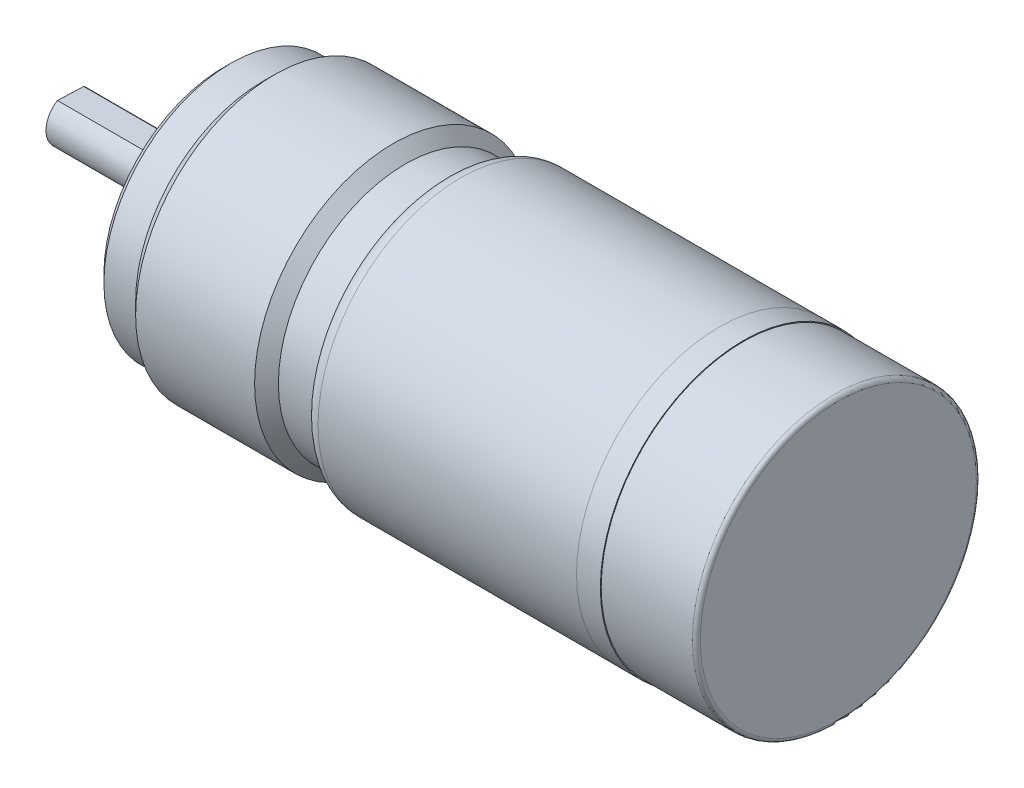
ISO-10303-21;
HEADER;
FILE_DESCRIPTION(('STEP AP214'),'2;1');
FILE_NAME('part.step','',(''),(''),'','','');
FILE_SCHEMA(('AUTOMOTIVE_DESIGN { 1 0 10303 214 1 1 1 1 }'));
ENDSEC;
DATA;
#1=APPLICATION_CONTEXT('core data for automotive mechanical design processes');
#2=APPLICATION_PROTOCOL_DEFINITION('international standard','automotive_design',2000,#1);
#3=PRODUCT_CONTEXT('',#1,'mechanical');
#4=PRODUCT('Part','Part','',(#3));
#5=PRODUCT_RELATED_PRODUCT_CATEGORY('part','',(#4));
#6=PRODUCT_DEFINITION_FORMATION('','',#4);
#7=PRODUCT_DEFINITION_CONTEXT('part definition',#1,'design');
#8=PRODUCT_DEFINITION('design','',#6,#7);
#9=PRODUCT_DEFINITION_SHAPE('','',#8);
#10=(LENGTH_UNIT() NAMED_UNIT(*) SI_UNIT(.MILLI.,.METRE.));
#11=(NAMED_UNIT(*) PLANE_ANGLE_UNIT() SI_UNIT($,.RADIAN.));
#12=(NAMED_UNIT(*) SI_UNIT($,.STERADIAN.) SOLID_ANGLE_UNIT());
#13=UNCERTAINTY_MEASURE_WITH_UNIT(LENGTH_MEASURE(1.E-05),#10,'distance_accuracy_value','');
#14=(GEOMETRIC_REPRESENTATION_CONTEXT(3) GLOBAL_UNCERTAINTY_ASSIGNED_CONTEXT((#13)) GLOBAL_UNIT_ASSIGNED_CONTEXT((#10,
#11,#12)) REPRESENTATION_CONTEXT('',''));
#15=CARTESIAN_POINT('',(0.,0.,0.));
#16=DIRECTION('',(0.,0.,1.));
#17=DIRECTION('',(1.,0.,0.));
#18=AXIS2_PLACEMENT_3D('',#15,#16,#17);
#19=CARTESIAN_POINT('',(26.3,0.,0.));
#20=DIRECTION('',(-1.,0.,0.));
#21=DIRECTION('',(0.,-1.,0.));
#22=AXIS2_PLACEMENT_3D('',#19,#20,#21);
#23=PLANE('',#22);
#24=CARTESIAN_POINT('',(26.3,9.19238815542526,9.19238815542498));
#25=DIRECTION('',(-1.,0.,0.));
#26=DIRECTION('',(0.,-1.,0.));
#27=AXIS2_PLACEMENT_3D('',#24,#25,#26);
#28=CIRCLE('',#27,1.5);
#29=CARTESIAN_POINT('',(26.3,7.69238815542527,9.19238815542499));
#30=VERTEX_POINT('',#29);
#31=EDGE_CURVE('E43',#30,#30,#28,.T.);
#32=ORIENTED_EDGE('',*,*,#31,.T.);
#33=EDGE_LOOP('',(#32));
#34=FACE_BOUND('',#33,.T.);
#35=ADVANCED_FACE('F36',(#34),#23,.T.);
#36=CARTESIAN_POINT('',(26.3,9.19238815542526,9.19238815542498));
#37=DIRECTION('',(-1.,0.,0.));
#38=DIRECTION('',(0.,-1.,0.));
#39=AXIS2_PLACEMENT_3D('',#36,#37,#38);
#40=CYLINDRICAL_SURFACE('',#39,1.5);
#41=ORIENTED_EDGE('',*,*,#31,.F.);
#42=EDGE_LOOP('',(#41));
#43=FACE_BOUND('',#42,.T.);
#44=CARTESIAN_POINT('',(19.3,9.19238815542526,9.19238815542498));
#45=DIRECTION('',(-1.,0.,0.));
#46=DIRECTION('',(0.,-1.,0.));
#47=AXIS2_PLACEMENT_3D('',#44,#45,#46);
#48=CIRCLE('',#47,1.5);
#49=CARTESIAN_POINT('',(19.3,7.69238815542527,9.19238815542499));
#50=VERTEX_POINT('',#49);
#51=EDGE_CURVE('E11',#50,#50,#48,.T.);
#52=ORIENTED_EDGE('',*,*,#51,.T.);
#53=EDGE_LOOP('',(#52));
#54=FACE_BOUND('',#53,.T.);
#55=ADVANCED_FACE('F160',(#43,#54),#40,.F.);
#56=CARTESIAN_POINT('',(26.3,0.,0.));
#57=DIRECTION('',(-1.,0.,0.));
#58=DIRECTION('',(0.,0.,-1.));
#59=AXIS2_PLACEMENT_3D('',#56,#57,#58);
#60=PLANE('',#59);
#61=CARTESIAN_POINT('',(26.3,-9.19238815542507,9.19238815542517));
#62=DIRECTION('',(-1.,0.,0.));
#63=DIRECTION('',(0.,0.,-1.));
#64=AXIS2_PLACEMENT_3D('',#61,#62,#63);
#65=CIRCLE('',#64,1.5);
#66=CARTESIAN_POINT('',(26.3,-9.19238815542507,7.69238815542517));
#67=VERTEX_POINT('',#66);
#68=EDGE_CURVE('E151',#67,#67,#65,.T.);
#69=ORIENTED_EDGE('',*,*,#68,.T.);
#70=EDGE_LOOP('',(#69));
#71=FACE_BOUND('',#70,.T.);
#72=ADVANCED_FACE('F163',(#71),#60,.T.);
#73=CARTESIAN_POINT('',(26.3,-9.19238815542507,9.19238815542517));
#74=DIRECTION('',(-1.,0.,0.));
#75=DIRECTION('',(0.,0.,-1.));
#76=AXIS2_PLACEMENT_3D('',#73,#74,#75);
#77=CYLINDRICAL_SURFACE('',#76,1.5);
#78=ORIENTED_EDGE('',*,*,#68,.F.);
#79=EDGE_LOOP('',(#78));
#80=FACE_BOUND('',#79,.T.);
#81=CARTESIAN_POINT('',(19.3,-9.19238815542507,9.19238815542517));
#82=DIRECTION('',(-1.,0.,0.));
#83=DIRECTION('',(0.,0.,-1.));
#84=AXIS2_PLACEMENT_3D('',#81,#82,#83);
#85=CIRCLE('',#84,1.5);
#86=CARTESIAN_POINT('',(19.3,-9.19238815542507,7.69238815542517));
#87=VERTEX_POINT('',#86);
#88=EDGE_CURVE('E154',#87,#87,#85,.T.);
#89=ORIENTED_EDGE('',*,*,#88,.T.);
#90=EDGE_LOOP('',(#89));
#91=FACE_BOUND('',#90,.T.);
#92=ADVANCED_FACE('F204',(#80,#91),#77,.F.);
#93=CARTESIAN_POINT('',(26.3,0.,0.));
#94=DIRECTION('',(-1.,0.,0.));
#95=DIRECTION('',(0.,1.,0.));
#96=AXIS2_PLACEMENT_3D('',#93,#94,#95);
#97=PLANE('',#96);
#98=CARTESIAN_POINT('',(26.3,-9.1923881554252,-9.19238815542504));
#99=DIRECTION('',(-1.,0.,0.));
#100=DIRECTION('',(0.,1.,0.));
#101=AXIS2_PLACEMENT_3D('',#98,#99,#100);
#102=CIRCLE('',#101,1.5);
#103=CARTESIAN_POINT('',(26.3,-7.6923881554252,-9.19238815542504));
#104=VERTEX_POINT('',#103);
#105=EDGE_CURVE('E145',#104,#104,#102,.T.);
#106=ORIENTED_EDGE('',*,*,#105,.T.);
#107=EDGE_LOOP('',(#106));
#108=FACE_BOUND('',#107,.T.);
#109=ADVANCED_FACE('F213',(#108),#97,.T.);
#110=CARTESIAN_POINT('',(26.3,-9.1923881554252,-9.19238815542504));
#111=DIRECTION('',(-1.,0.,0.));
#112=DIRECTION('',(0.,1.,0.));
#113=AXIS2_PLACEMENT_3D('',#110,#111,#112);
#114=CYLINDRICAL_SURFACE('',#113,1.5);
#115=ORIENTED_EDGE('',*,*,#105,.F.);
#116=EDGE_LOOP('',(#115));
#117=FACE_BOUND('',#116,.T.);
#118=CARTESIAN_POINT('',(19.3,-9.1923881554252,-9.19238815542504));
#119=DIRECTION('',(-1.,0.,0.));
#120=DIRECTION('',(0.,1.,0.));
#121=AXIS2_PLACEMENT_3D('',#118,#119,#120);
#122=CIRCLE('',#121,1.5);
#123=CARTESIAN_POINT('',(19.3,-7.6923881554252,-9.19238815542504));
#124=VERTEX_POINT('',#123);
#125=EDGE_CURVE('E148',#124,#124,#122,.T.);
#126=ORIENTED_EDGE('',*,*,#125,.T.);
#127=EDGE_LOOP('',(#126));
#128=FACE_BOUND('',#127,.T.);
#129=ADVANCED_FACE('F221',(#117,#128),#114,.F.);
#130=CARTESIAN_POINT('',(0.,0.,0.));
#131=DIRECTION('',(-1.,0.,0.));
#132=DIRECTION('',(0.,0.,1.));
#133=AXIS2_PLACEMENT_3D('',#130,#131,#132);
#134=CYLINDRICAL_SURFACE('',#133,10.);
#135=DIRECTION('',(-1.,0.,0.));
#136=VECTOR('',#135,1.);
#137=CARTESIAN_POINT('',(19.3,-9.,-4.35889894354067));
#138=LINE('',#137,#136);
#139=CARTESIAN_POINT('',(19.3,-9.,-4.35889894354067));
#140=VERTEX_POINT('',#139);
#141=CARTESIAN_POINT('',(16.3,-9.,-4.35889894354067));
#142=VERTEX_POINT('',#141);
#143=EDGE_CURVE('E90',#140,#142,#138,.T.);
#144=ORIENTED_EDGE('',*,*,#143,.T.);
#145=CARTESIAN_POINT('',(16.3,0.,0.));
#146=DIRECTION('',(-1.,0.,0.));
#147=DIRECTION('',(0.,0.,1.));
#148=AXIS2_PLACEMENT_3D('',#145,#146,#147);
#149=CIRCLE('',#148,10.);
#150=CARTESIAN_POINT('',(16.3,9.,-4.35889894354067));
#151=VERTEX_POINT('',#150);
#152=EDGE_CURVE('E109',#151,#142,#149,.T.);
#153=ORIENTED_EDGE('',*,*,#152,.F.);
#154=DIRECTION('',(-1.,0.,0.));
#155=VECTOR('',#154,1.);
#156=CARTESIAN_POINT('',(19.3,9.,-4.35889894354067));
#157=LINE('',#156,#155);
#158=CARTESIAN_POINT('',(19.3,9.,-4.35889894354067));
#159=VERTEX_POINT('',#158);
#160=EDGE_CURVE('E58',#159,#151,#157,.T.);
#161=ORIENTED_EDGE('',*,*,#160,.F.);
#162=CARTESIAN_POINT('',(19.3,0.,0.));
#163=DIRECTION('',(-1.,0.,0.));
#164=DIRECTION('',(0.,0.,1.));
#165=AXIS2_PLACEMENT_3D('',#162,#163,#164);
#166=CIRCLE('',#165,10.);
#167=EDGE_CURVE('E108',#159,#140,#166,.T.);
#168=ORIENTED_EDGE('',*,*,#167,.T.);
#169=EDGE_LOOP('',(#144,#153,#161,#168));
#170=FACE_BOUND('',#169,.T.);
#171=ADVANCED_FACE('F229',(#170),#134,.T.);
#172=CARTESIAN_POINT('',(0.,0.,0.));
#173=DIRECTION('',(-1.,0.,0.));
#174=DIRECTION('',(0.,0.,1.));
#175=AXIS2_PLACEMENT_3D('',#172,#173,#174);
#176=CYLINDRICAL_SURFACE('',#175,18.);
#177=CARTESIAN_POINT('',(49.3,0.,0.));
#178=DIRECTION('',(-1.,0.,0.));
#179=DIRECTION('',(0.,0.,1.));
#180=AXIS2_PLACEMENT_3D('',#177,#178,#179);
#181=CIRCLE('',#180,18.);
#182=CARTESIAN_POINT('',(49.3,0.,18.));
#183=VERTEX_POINT('',#182);
#184=EDGE_CURVE('E136',#183,#183,#181,.T.);
#185=ORIENTED_EDGE('',*,*,#184,.F.);
#186=EDGE_LOOP('',(#185));
#187=FACE_BOUND('',#186,.T.);
#188=CARTESIAN_POINT('',(81.9,0.,0.));
#189=DIRECTION('',(-1.,0.,0.));
#190=DIRECTION('',(0.,0.,1.));
#191=AXIS2_PLACEMENT_3D('',#188,#189,#190);
#192=CIRCLE('',#191,18.);
#193=CARTESIAN_POINT('',(81.9,0.,18.));
#194=VERTEX_POINT('',#193);
#195=EDGE_CURVE('E523',#194,#194,#192,.T.);
#196=ORIENTED_EDGE('',*,*,#195,.T.);
#197=EDGE_LOOP('',(#196));
#198=FACE_BOUND('',#197,.T.);
#199=ADVANCED_FACE('F238',(#187,#198),#176,.T.);
#200=CARTESIAN_POINT('',(0.,0.,0.));
#201=DIRECTION('',(-1.,0.,0.));
#202=DIRECTION('',(0.,0.,1.));
#203=AXIS2_PLACEMENT_3D('',#200,#201,#202);
#204=CYLINDRICAL_SURFACE('',#203,3.);
#205=CARTESIAN_POINT('',(16.3,0.,0.));
#206=DIRECTION('',(-1.,0.,0.));
#207=DIRECTION('',(0.,0.,1.));
#208=AXIS2_PLACEMENT_3D('',#205,#206,#207);
#209=CIRCLE('',#208,3.);
#210=CARTESIAN_POINT('',(16.3,0.,3.));
#211=VERTEX_POINT('',#210);
#212=EDGE_CURVE('E551',#211,#211,#209,.T.);
#213=ORIENTED_EDGE('',*,*,#212,.T.);
#214=EDGE_LOOP('',(#213));
#215=FACE_BOUND('',#214,.T.);
#216=CARTESIAN_POINT('',(0.,0.,0.));
#217=DIRECTION('',(-1.,0.,0.));
#218=DIRECTION('',(0.,0.,1.));
#219=AXIS2_PLACEMENT_3D('',#216,#217,#218);
#220=CIRCLE('',#219,3.);
#221=CARTESIAN_POINT('',(0.,2.43449128570991,-1.75306935966678));
#222=VERTEX_POINT('',#221);
#223=CARTESIAN_POINT('',(0.,2.561822527077,1.56111029071006));
#224=VERTEX_POINT('',#223);
#225=EDGE_CURVE('E547',#222,#224,#220,.T.);
#226=ORIENTED_EDGE('',*,*,#225,.F.);
#227=DIRECTION('',(-1.,0.,0.));
#228=VECTOR('',#227,1.);
#229=CARTESIAN_POINT('',(12.,2.43449128570991,-1.75306935966678));
#230=LINE('',#229,#228);
#231=CARTESIAN_POINT('',(12.,2.43449128570991,-1.75306935966678));
#232=VERTEX_POINT('',#231);
#233=EDGE_CURVE('E545',#232,#222,#230,.T.);
#234=ORIENTED_EDGE('',*,*,#233,.F.);
#235=CARTESIAN_POINT('',(12.,0.,0.));
#236=DIRECTION('',(-1.,0.,0.));
#237=DIRECTION('',(0.,0.,1.));
#238=AXIS2_PLACEMENT_3D('',#235,#236,#237);
#239=CIRCLE('',#238,3.);
#240=CARTESIAN_POINT('',(12.,2.561822527077,1.56111029071006));
#241=VERTEX_POINT('',#240);
#242=EDGE_CURVE('E539',#241,#232,#239,.T.);
#243=ORIENTED_EDGE('',*,*,#242,.F.);
#244=DIRECTION('',(-1.,0.,0.));
#245=VECTOR('',#244,1.);
#246=CARTESIAN_POINT('',(12.,2.561822527077,1.56111029071006));
#247=LINE('',#246,#245);
#248=EDGE_CURVE('E542',#241,#224,#247,.T.);
#249=ORIENTED_EDGE('',*,*,#248,.T.);
#250=EDGE_LOOP('',(#226,#234,#243,#249));
#251=FACE_BOUND('',#250,.T.);
#252=ADVANCED_FACE('F248',(#215,#251),#204,.T.);
#253=CARTESIAN_POINT('',(0.,0.,0.));
#254=DIRECTION('',(-1.,0.,0.));
#255=DIRECTION('',(0.,0.,1.));
#256=AXIS2_PLACEMENT_3D('',#253,#254,#255);
#257=PLANE('',#256);
#258=ORIENTED_EDGE('',*,*,#225,.T.);
#259=DIRECTION('',(0.,-0.0383918137913446,-0.999262762557382));
#260=VECTOR('',#259,1.);
#261=CARTESIAN_POINT('',(0.,2.49815690639346,-0.0959795344783614));
#262=LINE('',#261,#260);
#263=EDGE_CURVE('E536',#224,#222,#262,.T.);
#264=ORIENTED_EDGE('',*,*,#263,.T.);
#265=EDGE_LOOP('',(#258,#264));
#266=FACE_BOUND('',#265,.T.);
#267=ADVANCED_FACE('F258',(#266),#257,.T.);
#268=CARTESIAN_POINT('',(49.3,0.,0.));
#269=DIRECTION('',(-1.,0.,0.));
#270=DIRECTION('',(0.,0.,1.));
#271=AXIS2_PLACEMENT_3D('',#268,#269,#270);
#272=TOROIDAL_SURFACE('',#271,16.,2.);
#273=ORIENTED_EDGE('',*,*,#184,.T.);
#274=EDGE_LOOP('',(#273));
#275=FACE_BOUND('',#274,.T.);
#276=CARTESIAN_POINT('',(47.3,0.,0.));
#277=DIRECTION('',(-1.,0.,0.));
#278=DIRECTION('',(0.,0.,1.));
#279=AXIS2_PLACEMENT_3D('',#276,#277,#278);
#280=CIRCLE('',#279,16.);
#281=CARTESIAN_POINT('',(47.3,0.,16.));
#282=VERTEX_POINT('',#281);
#283=EDGE_CURVE('E133',#282,#282,#280,.T.);
#284=ORIENTED_EDGE('',*,*,#283,.F.);
#285=EDGE_LOOP('',(#284));
#286=FACE_BOUND('',#285,.T.);
#287=ADVANCED_FACE('F266',(#275,#286),#272,.T.);
#288=CARTESIAN_POINT('',(0.,0.,0.));
#289=DIRECTION('',(-1.,0.,0.));
#290=DIRECTION('',(0.,0.,1.));
#291=AXIS2_PLACEMENT_3D('',#288,#289,#290);
#292=CYLINDRICAL_SURFACE('',#291,16.);
#293=ORIENTED_EDGE('',*,*,#283,.T.);
#294=EDGE_LOOP('',(#293));
#295=FACE_BOUND('',#294,.T.);
#296=CARTESIAN_POINT('',(42.3,0.,0.));
#297=DIRECTION('',(-1.,0.,0.));
#298=DIRECTION('',(0.,0.,1.));
#299=AXIS2_PLACEMENT_3D('',#296,#297,#298);
#300=CIRCLE('',#299,16.);
#301=CARTESIAN_POINT('',(42.3,0.,16.));
#302=VERTEX_POINT('',#301);
#303=EDGE_CURVE('E130',#302,#302,#300,.T.);
#304=ORIENTED_EDGE('',*,*,#303,.F.);
#305=EDGE_LOOP('',(#304));
#306=FACE_BOUND('',#305,.T.);
#307=ADVANCED_FACE('F275',(#295,#306),#292,.T.);
#308=CARTESIAN_POINT('',(40.8,0.,0.));
#309=DIRECTION('',(-1.,0.,0.));
#310=DIRECTION('',(0.,0.,1.));
#311=AXIS2_PLACEMENT_3D('',#308,#309,#310);
#312=CONICAL_SURFACE('',#311,17.5,0.785398163397448);
#313=ORIENTED_EDGE('',*,*,#303,.T.);
#314=EDGE_LOOP('',(#313));
#315=FACE_BOUND('',#314,.T.);
#316=CARTESIAN_POINT('',(40.8,0.,0.));
#317=DIRECTION('',(-1.,0.,0.));
#318=DIRECTION('',(0.,0.,1.));
#319=AXIS2_PLACEMENT_3D('',#316,#317,#318);
#320=CIRCLE('',#319,17.5);
#321=CARTESIAN_POINT('',(40.8,0.,17.5));
#322=VERTEX_POINT('',#321);
#323=EDGE_CURVE('E127',#322,#322,#320,.T.);
#324=ORIENTED_EDGE('',*,*,#323,.F.);
#325=EDGE_LOOP('',(#324));
#326=FACE_BOUND('',#325,.T.);
#327=ADVANCED_FACE('F283',(#315,#326),#312,.T.);
#328=CARTESIAN_POINT('',(0.,0.,0.));
#329=DIRECTION('',(-1.,0.,0.));
#330=DIRECTION('',(0.,0.,1.));
#331=AXIS2_PLACEMENT_3D('',#328,#329,#330);
#332=CYLINDRICAL_SURFACE('',#331,17.5);
#333=ORIENTED_EDGE('',*,*,#323,.T.);
#334=EDGE_LOOP('',(#333));
#335=FACE_BOUND('',#334,.T.);
#336=CARTESIAN_POINT('',(25.8,0.,0.));
#337=DIRECTION('',(-1.,0.,0.));
#338=DIRECTION('',(0.,0.,1.));
#339=AXIS2_PLACEMENT_3D('',#336,#337,#338);
#340=CIRCLE('',#339,17.5);
#341=CARTESIAN_POINT('',(25.8,0.,17.5));
#342=VERTEX_POINT('',#341);
#343=EDGE_CURVE('E124',#342,#342,#340,.T.);
#344=ORIENTED_EDGE('',*,*,#343,.F.);
#345=EDGE_LOOP('',(#344));
#346=FACE_BOUND('',#345,.T.);
#347=ADVANCED_FACE('F292',(#335,#346),#332,.T.);
#348=CARTESIAN_POINT('',(24.3,0.,0.));
#349=DIRECTION('',(1.,0.,0.));
#350=DIRECTION('',(0.,0.,-1.));
#351=AXIS2_PLACEMENT_3D('',#348,#349,#350);
#352=CONICAL_SURFACE('',#351,16.,0.785398163397448);
#353=ORIENTED_EDGE('',*,*,#343,.T.);
#354=EDGE_LOOP('',(#353));
#355=FACE_BOUND('',#354,.T.);
#356=CARTESIAN_POINT('',(24.3,0.,0.));
#357=DIRECTION('',(-1.,0.,0.));
#358=DIRECTION('',(0.,0.,1.));
#359=AXIS2_PLACEMENT_3D('',#356,#357,#358);
#360=CIRCLE('',#359,16.);
#361=CARTESIAN_POINT('',(24.3,0.,16.));
#362=VERTEX_POINT('',#361);
#363=EDGE_CURVE('E121',#362,#362,#360,.T.);
#364=ORIENTED_EDGE('',*,*,#363,.F.);
#365=EDGE_LOOP('',(#364));
#366=FACE_BOUND('',#365,.T.);
#367=ADVANCED_FACE('F187',(#355,#366),#352,.T.);
#368=CARTESIAN_POINT('',(0.,0.,0.));
#369=DIRECTION('',(-1.,0.,0.));
#370=DIRECTION('',(0.,0.,1.));
#371=AXIS2_PLACEMENT_3D('',#368,#369,#370);
#372=CYLINDRICAL_SURFACE('',#371,16.);
#373=ORIENTED_EDGE('',*,*,#363,.T.);
#374=EDGE_LOOP('',(#373));
#375=FACE_BOUND('',#374,.T.);
#376=CARTESIAN_POINT('',(20.3,0.,0.));
#377=DIRECTION('',(-1.,0.,0.));
#378=DIRECTION('',(0.,0.,1.));
#379=AXIS2_PLACEMENT_3D('',#376,#377,#378);
#380=CIRCLE('',#379,16.);
#381=CARTESIAN_POINT('',(20.3,0.,16.));
#382=VERTEX_POINT('',#381);
#383=EDGE_CURVE('E118',#382,#382,#380,.T.);
#384=ORIENTED_EDGE('',*,*,#383,.F.);
#385=EDGE_LOOP('',(#384));
#386=FACE_BOUND('',#385,.T.);
#387=ADVANCED_FACE('F181',(#375,#386),#372,.T.);
#388=CARTESIAN_POINT('',(19.3,0.,0.));
#389=DIRECTION('',(1.,0.,0.));
#390=DIRECTION('',(0.,0.,-1.));
#391=AXIS2_PLACEMENT_3D('',#388,#389,#390);
#392=CONICAL_SURFACE('',#391,15.,0.785398163397448);
#393=ORIENTED_EDGE('',*,*,#383,.T.);
#394=EDGE_LOOP('',(#393));
#395=FACE_BOUND('',#394,.T.);
#396=CARTESIAN_POINT('',(19.3,0.,0.));
#397=DIRECTION('',(-1.,0.,0.));
#398=DIRECTION('',(0.,0.,1.));
#399=AXIS2_PLACEMENT_3D('',#396,#397,#398);
#400=CIRCLE('',#399,15.);
#401=CARTESIAN_POINT('',(19.3,0.,15.));
#402=VERTEX_POINT('',#401);
#403=EDGE_CURVE('E111',#402,#402,#400,.T.);
#404=ORIENTED_EDGE('',*,*,#403,.F.);
#405=EDGE_LOOP('',(#404));
#406=FACE_BOUND('',#405,.T.);
#407=ADVANCED_FACE('F168',(#395,#406),#392,.T.);
#408=CARTESIAN_POINT('',(19.3,0.,0.));
#409=DIRECTION('',(-1.,0.,0.));
#410=DIRECTION('',(0.,0.,1.));
#411=AXIS2_PLACEMENT_3D('',#408,#409,#410);
#412=PLANE('',#411);
#413=ORIENTED_EDGE('',*,*,#51,.F.);
#414=EDGE_LOOP('',(#413));
#415=FACE_BOUND('',#414,.T.);
#416=ORIENTED_EDGE('',*,*,#88,.F.);
#417=EDGE_LOOP('',(#416));
#418=FACE_BOUND('',#417,.T.);
#419=ORIENTED_EDGE('',*,*,#125,.F.);
#420=EDGE_LOOP('',(#419));
#421=FACE_BOUND('',#420,.T.);
#422=CARTESIAN_POINT('',(19.3,9.19238815542507,-9.19238815542517));
#423=DIRECTION('',(-1.,0.,0.));
#424=DIRECTION('',(0.,0.,1.));
#425=AXIS2_PLACEMENT_3D('',#422,#423,#424);
#426=CIRCLE('',#425,1.5);
#427=CARTESIAN_POINT('',(19.3,9.19238815542507,-7.69238815542517));
#428=VERTEX_POINT('',#427);
#429=EDGE_CURVE('E177',#428,#428,#426,.T.);
#430=ORIENTED_EDGE('',*,*,#429,.F.);
#431=EDGE_LOOP('',(#430));
#432=FACE_BOUND('',#431,.T.);
#433=ORIENTED_EDGE('',*,*,#403,.T.);
#434=EDGE_LOOP('',(#433));
#435=FACE_BOUND('',#434,.T.);
#436=ORIENTED_EDGE('',*,*,#167,.F.);
#437=DIRECTION('',(0.,0.,1.));
#438=VECTOR('',#437,1.);
#439=CARTESIAN_POINT('',(19.3,9.,0.));
#440=LINE('',#439,#438);
#441=CARTESIAN_POINT('',(19.3,9.,4.35889894354067));
#442=VERTEX_POINT('',#441);
#443=EDGE_CURVE('E107',#159,#442,#440,.T.);
#444=ORIENTED_EDGE('',*,*,#443,.T.);
#445=CARTESIAN_POINT('',(19.3,-9.,4.35889894354067));
#446=VERTEX_POINT('',#445);
#447=EDGE_CURVE('E101',#446,#442,#166,.T.);
#448=ORIENTED_EDGE('',*,*,#447,.F.);
#449=DIRECTION('',(0.,0.,-1.));
#450=VECTOR('',#449,1.);
#451=CARTESIAN_POINT('',(19.3,-9.,0.));
#452=LINE('',#451,#450);
#453=EDGE_CURVE('E87',#446,#140,#452,.T.);
#454=ORIENTED_EDGE('',*,*,#453,.T.);
#455=EDGE_LOOP('',(#436,#444,#448,#454));
#456=FACE_BOUND('',#455,.T.);
#457=ADVANCED_FACE('F106',(#415,#418,#421,#432,#435,#456),#412,.T.);
#458=DIRECTION('',(-1.,0.,0.));
#459=VECTOR('',#458,1.);
#460=CARTESIAN_POINT('',(19.3,-9.,4.35889894354067));
#461=LINE('',#460,#459);
#462=CARTESIAN_POINT('',(16.3,-9.,4.35889894354067));
#463=VERTEX_POINT('',#462);
#464=EDGE_CURVE('E50',#446,#463,#461,.T.);
#465=ORIENTED_EDGE('',*,*,#464,.F.);
#466=ORIENTED_EDGE('',*,*,#447,.T.);
#467=DIRECTION('',(-1.,0.,0.));
#468=VECTOR('',#467,1.);
#469=CARTESIAN_POINT('',(19.3,9.,4.35889894354067));
#470=LINE('',#469,#468);
#471=CARTESIAN_POINT('',(16.3,9.,4.35889894354067));
#472=VERTEX_POINT('',#471);
#473=EDGE_CURVE('E521',#442,#472,#470,.T.);
#474=ORIENTED_EDGE('',*,*,#473,.T.);
#475=EDGE_CURVE('E103',#463,#472,#149,.T.);
#476=ORIENTED_EDGE('',*,*,#475,.F.);
#477=EDGE_LOOP('',(#465,#466,#474,#476));
#478=FACE_BOUND('',#477,.T.);
#479=ADVANCED_FACE('F99',(#478),#134,.T.);
#480=CARTESIAN_POINT('',(16.3,0.,0.));
#481=DIRECTION('',(-1.,0.,0.));
#482=DIRECTION('',(0.,0.,1.));
#483=AXIS2_PLACEMENT_3D('',#480,#481,#482);
#484=PLANE('',#483);
#485=DIRECTION('',(0.,0.,-1.));
#486=VECTOR('',#485,1.);
#487=CARTESIAN_POINT('',(16.3,-9.,0.));
#488=LINE('',#487,#486);
#489=EDGE_CURVE('E95',#463,#142,#488,.T.);
#490=ORIENTED_EDGE('',*,*,#489,.F.);
#491=ORIENTED_EDGE('',*,*,#475,.T.);
#492=DIRECTION('',(0.,0.,1.));
#493=VECTOR('',#492,1.);
#494=CARTESIAN_POINT('',(16.3,9.,0.));
#495=LINE('',#494,#493);
#496=EDGE_CURVE('E517',#151,#472,#495,.T.);
#497=ORIENTED_EDGE('',*,*,#496,.F.);
#498=ORIENTED_EDGE('',*,*,#152,.T.);
#499=EDGE_LOOP('',(#490,#491,#497,#498));
#500=FACE_BOUND('',#499,.T.);
#501=ORIENTED_EDGE('',*,*,#212,.F.);
#502=EDGE_LOOP('',(#501));
#503=FACE_BOUND('',#502,.T.);
#504=ADVANCED_FACE('F337',(#500,#503),#484,.T.);
#505=CARTESIAN_POINT('',(12.,2.49815690639346,-0.0959795344783614));
#506=DIRECTION('',(0.,0.999262762557382,-0.0383918137913446));
#507=DIRECTION('',(0.,0.0383918137913446,0.999262762557382));
#508=AXIS2_PLACEMENT_3D('',#505,#506,#507);
#509=PLANE('',#508);
#510=ORIENTED_EDGE('',*,*,#263,.F.);
#511=ORIENTED_EDGE('',*,*,#248,.F.);
#512=DIRECTION('',(0.,-0.0383918137913446,-0.999262762557382));
#513=VECTOR('',#512,1.);
#514=CARTESIAN_POINT('',(12.,2.49815690639346,-0.0959795344783614));
#515=LINE('',#514,#513);
#516=EDGE_CURVE('E537',#241,#232,#515,.T.);
#517=ORIENTED_EDGE('',*,*,#516,.T.);
#518=ORIENTED_EDGE('',*,*,#233,.T.);
#519=EDGE_LOOP('',(#510,#511,#517,#518));
#520=FACE_BOUND('',#519,.T.);
#521=ADVANCED_FACE('F344',(#520),#509,.T.);
#522=CARTESIAN_POINT('',(12.,0.,0.));
#523=DIRECTION('',(-1.,0.,0.));
#524=DIRECTION('',(0.,0.,1.));
#525=AXIS2_PLACEMENT_3D('',#522,#523,#524);
#526=PLANE('',#525);
#527=ORIENTED_EDGE('',*,*,#516,.F.);
#528=ORIENTED_EDGE('',*,*,#242,.T.);
#529=EDGE_LOOP('',(#527,#528));
#530=FACE_BOUND('',#529,.T.);
#531=ADVANCED_FACE('F374',(#530),#526,.T.);
#532=CARTESIAN_POINT('',(0.,0.,0.));
#533=DIRECTION('',(-1.,0.,0.));
#534=DIRECTION('',(0.,0.,1.));
#535=AXIS2_PLACEMENT_3D('',#532,#533,#534);
#536=CYLINDRICAL_SURFACE('',#535,18.01);
#537=CARTESIAN_POINT('',(81.9,0.,0.));
#538=DIRECTION('',(-1.,0.,0.));
#539=DIRECTION('',(0.,0.,1.));
#540=AXIS2_PLACEMENT_3D('',#537,#538,#539);
#541=CIRCLE('',#540,18.01);
#542=CARTESIAN_POINT('',(81.9,0.,18.01));
#543=VERTEX_POINT('',#542);
#544=EDGE_CURVE('E527',#543,#543,#541,.T.);
#545=ORIENTED_EDGE('',*,*,#544,.F.);
#546=EDGE_LOOP('',(#545));
#547=FACE_BOUND('',#546,.T.);
#548=CARTESIAN_POINT('',(84.9,0.,0.));
#549=DIRECTION('',(-1.,0.,0.));
#550=DIRECTION('',(0.,0.,1.));
#551=AXIS2_PLACEMENT_3D('',#548,#549,#550);
#552=CIRCLE('',#551,18.01);
#553=CARTESIAN_POINT('',(84.9,0.,18.01));
#554=VERTEX_POINT('',#553);
#555=EDGE_CURVE('E530',#554,#554,#552,.T.);
#556=ORIENTED_EDGE('',*,*,#555,.T.);
#557=EDGE_LOOP('',(#556));
#558=FACE_BOUND('',#557,.T.);
#559=ADVANCED_FACE('F383',(#547,#558),#536,.T.);
#560=CARTESIAN_POINT('',(81.9,0.,-18.));
#561=DIRECTION('',(1.,0.,0.));
#562=DIRECTION('',(0.,0.,-1.));
#563=AXIS2_PLACEMENT_3D('',#560,#561,#562);
#564=PLANE('',#563);
#565=ORIENTED_EDGE('',*,*,#195,.F.);
#566=EDGE_LOOP('',(#565));
#567=FACE_BOUND('',#566,.T.);
#568=ORIENTED_EDGE('',*,*,#544,.T.);
#569=EDGE_LOOP('',(#568));
#570=FACE_BOUND('',#569,.T.);
#571=ADVANCED_FACE('F359',(#567,#570),#564,.F.);
#572=CARTESIAN_POINT('',(96.9,0.,0.));
#573=DIRECTION('',(1.,0.,0.));
#574=DIRECTION('',(0.,0.,-1.));
#575=AXIS2_PLACEMENT_3D('',#572,#573,#574);
#576=PLANE('',#575);
#577=CARTESIAN_POINT('',(96.9,0.,0.));
#578=DIRECTION('',(1.,0.,0.));
#579=DIRECTION('',(0.,0.,-1.));
#580=AXIS2_PLACEMENT_3D('',#577,#578,#579);
#581=CIRCLE('',#580,17.4);
#582=CARTESIAN_POINT('',(96.9,0.,-17.4));
#583=VERTEX_POINT('',#582);
#584=EDGE_CURVE('E142',#583,#583,#581,.T.);
#585=ORIENTED_EDGE('',*,*,#584,.T.);
#586=EDGE_LOOP('',(#585));
#587=FACE_BOUND('',#586,.T.);
#588=ADVANCED_FACE('F353',(#587),#576,.T.);
#589=CARTESIAN_POINT('',(96.4,0.,0.));
#590=DIRECTION('',(1.,0.,0.));
#591=DIRECTION('',(0.,0.,-1.));
#592=AXIS2_PLACEMENT_3D('',#589,#590,#591);
#593=TOROIDAL_SURFACE('',#592,17.4,0.5);
#594=ORIENTED_EDGE('',*,*,#584,.F.);
#595=EDGE_LOOP('',(#594));
#596=FACE_BOUND('',#595,.T.);
#597=CARTESIAN_POINT('',(96.4,0.,0.));
#598=DIRECTION('',(1.,0.,0.));
#599=DIRECTION('',(0.,0.,-1.));
#600=AXIS2_PLACEMENT_3D('',#597,#598,#599);
#601=CIRCLE('',#600,17.9);
#602=CARTESIAN_POINT('',(96.4,0.,-17.9));
#603=VERTEX_POINT('',#602);
#604=EDGE_CURVE('E139',#603,#603,#601,.F.);
#605=ORIENTED_EDGE('',*,*,#604,.F.);
#606=EDGE_LOOP('',(#605));
#607=FACE_BOUND('',#606,.T.);
#608=ADVANCED_FACE('F358',(#596,#607),#593,.T.);
#609=CARTESIAN_POINT('',(96.9,0.,0.));
#610=DIRECTION('',(-1.,0.,0.));
#611=DIRECTION('',(0.,0.,1.));
#612=AXIS2_PLACEMENT_3D('',#609,#610,#611);
#613=CYLINDRICAL_SURFACE('',#612,17.9);
#614=ORIENTED_EDGE('',*,*,#604,.T.);
#615=EDGE_LOOP('',(#614));
#616=FACE_BOUND('',#615,.T.);
#617=CARTESIAN_POINT('',(84.9,0.,0.));
#618=DIRECTION('',(-1.,0.,0.));
#619=DIRECTION('',(0.,0.,1.));
#620=AXIS2_PLACEMENT_3D('',#617,#618,#619);
#621=CIRCLE('',#620,17.9);
#622=CARTESIAN_POINT('',(84.9,0.,17.9));
#623=VERTEX_POINT('',#622);
#624=EDGE_CURVE('E533',#623,#623,#621,.T.);
#625=ORIENTED_EDGE('',*,*,#624,.F.);
#626=EDGE_LOOP('',(#625));
#627=FACE_BOUND('',#626,.T.);
#628=ADVANCED_FACE('F387',(#616,#627),#613,.T.);
#629=CARTESIAN_POINT('',(84.9,0.,18.));
#630=DIRECTION('',(-1.,0.,0.));
#631=DIRECTION('',(0.,0.,1.));
#632=AXIS2_PLACEMENT_3D('',#629,#630,#631);
#633=PLANE('',#632);
#634=ORIENTED_EDGE('',*,*,#624,.T.);
#635=EDGE_LOOP('',(#634));
#636=FACE_BOUND('',#635,.T.);
#637=ORIENTED_EDGE('',*,*,#555,.F.);
#638=EDGE_LOOP('',(#637));
#639=FACE_BOUND('',#638,.T.);
#640=ADVANCED_FACE('F392',(#636,#639),#633,.F.);
#641=CARTESIAN_POINT('',(19.3,9.,0.));
#642=DIRECTION('',(0.,-1.,0.));
#643=DIRECTION('',(0.,0.,-1.));
#644=AXIS2_PLACEMENT_3D('',#641,#642,#643);
#645=PLANE('',#644);
#646=ORIENTED_EDGE('',*,*,#496,.T.);
#647=ORIENTED_EDGE('',*,*,#473,.F.);
#648=ORIENTED_EDGE('',*,*,#443,.F.);
#649=ORIENTED_EDGE('',*,*,#160,.T.);
#650=EDGE_LOOP('',(#646,#647,#648,#649));
#651=FACE_BOUND('',#650,.T.);
#652=ADVANCED_FACE('F402',(#651),#645,.F.);
#653=CARTESIAN_POINT('',(19.3,-9.,0.));
#654=DIRECTION('',(0.,1.,0.));
#655=DIRECTION('',(0.,0.,1.));
#656=AXIS2_PLACEMENT_3D('',#653,#654,#655);
#657=PLANE('',#656);
#658=ORIENTED_EDGE('',*,*,#489,.T.);
#659=ORIENTED_EDGE('',*,*,#143,.F.);
#660=ORIENTED_EDGE('',*,*,#453,.F.);
#661=ORIENTED_EDGE('',*,*,#464,.T.);
#662=EDGE_LOOP('',(#658,#659,#660,#661));
#663=FACE_BOUND('',#662,.T.);
#664=ADVANCED_FACE('F88',(#663),#657,.F.);
#665=CARTESIAN_POINT('',(26.3,9.19238815542507,-9.19238815542517));
#666=DIRECTION('',(-1.,0.,0.));
#667=DIRECTION('',(0.,0.,1.));
#668=AXIS2_PLACEMENT_3D('',#665,#666,#667);
#669=CYLINDRICAL_SURFACE('',#668,1.5);
#670=CARTESIAN_POINT('',(26.3,9.19238815542507,-9.19238815542517));
#671=DIRECTION('',(-1.,0.,0.));
#672=DIRECTION('',(0.,0.,1.));
#673=AXIS2_PLACEMENT_3D('',#670,#671,#672);
#674=CIRCLE('',#673,1.5);
#675=CARTESIAN_POINT('',(26.3,9.19238815542507,-7.69238815542517));
#676=VERTEX_POINT('',#675);
#677=EDGE_CURVE('E512',#676,#676,#674,.T.);
#678=ORIENTED_EDGE('',*,*,#677,.F.);
#679=EDGE_LOOP('',(#678));
#680=FACE_BOUND('',#679,.T.);
#681=ORIENTED_EDGE('',*,*,#429,.T.);
#682=EDGE_LOOP('',(#681));
#683=FACE_BOUND('',#682,.T.);
#684=ADVANCED_FACE('F446',(#680,#683),#669,.F.);
#685=CARTESIAN_POINT('',(26.3,0.,0.));
#686=DIRECTION('',(-1.,0.,0.));
#687=DIRECTION('',(0.,0.,1.));
#688=AXIS2_PLACEMENT_3D('',#685,#686,#687);
#689=PLANE('',#688);
#690=ORIENTED_EDGE('',*,*,#677,.T.);
#691=EDGE_LOOP('',(#690));
#692=FACE_BOUND('',#691,.T.);
#693=ADVANCED_FACE('F453',(#692),#689,.T.);
#694=CLOSED_SHELL('',(#35,#55,#72,#92,#109,#129,#171,#199,#252,#267,#287,#307,#327,#347,#367,
#387,#407,#457,#479,#504,#521,#531,#559,#571,#588,#608,#628,#640,#652,#664,#684,#693));
#695=MANIFOLD_SOLID_BREP('B2',#694);
#696=ADVANCED_BREP_SHAPE_REPRESENTATION('',(#18,#695),#14);
#697=SHAPE_DEFINITION_REPRESENTATION(#9,#696);
ENDSEC;
END-ISO-10303-21;
